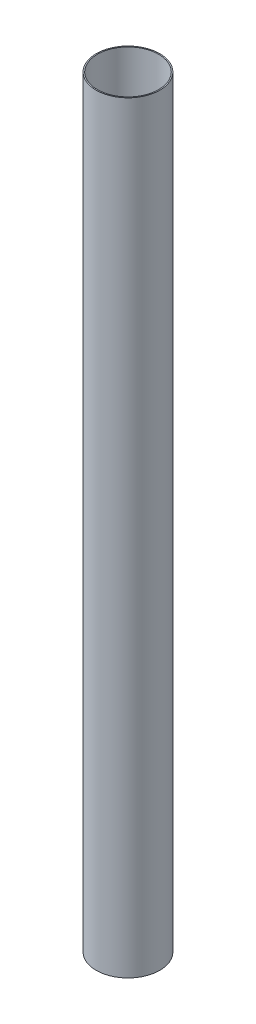
ISO-10303-21;
HEADER;
FILE_DESCRIPTION(('STEP AP214'),'2;1');
FILE_NAME('part.step','',(''),(''),'','','');
FILE_SCHEMA(('AUTOMOTIVE_DESIGN { 1 0 10303 214 1 1 1 1 }'));
ENDSEC;
DATA;
#1=APPLICATION_CONTEXT('core data for automotive mechanical design processes');
#2=APPLICATION_PROTOCOL_DEFINITION('international standard','automotive_design',2000,#1);
#3=PRODUCT_CONTEXT('',#1,'mechanical');
#4=PRODUCT('Part','Part','',(#3));
#5=PRODUCT_RELATED_PRODUCT_CATEGORY('part','',(#4));
#6=PRODUCT_DEFINITION_FORMATION('','',#4);
#7=PRODUCT_DEFINITION_CONTEXT('part definition',#1,'design');
#8=PRODUCT_DEFINITION('design','',#6,#7);
#9=PRODUCT_DEFINITION_SHAPE('','',#8);
#10=(LENGTH_UNIT() NAMED_UNIT(*) SI_UNIT(.MILLI.,.METRE.));
#11=(NAMED_UNIT(*) PLANE_ANGLE_UNIT() SI_UNIT($,.RADIAN.));
#12=(NAMED_UNIT(*) SI_UNIT($,.STERADIAN.) SOLID_ANGLE_UNIT());
#13=UNCERTAINTY_MEASURE_WITH_UNIT(LENGTH_MEASURE(1.E-05),#10,'distance_accuracy_value','');
#14=(GEOMETRIC_REPRESENTATION_CONTEXT(3) GLOBAL_UNCERTAINTY_ASSIGNED_CONTEXT((#13)) GLOBAL_UNIT_ASSIGNED_CONTEXT((#10,
#11,#12)) REPRESENTATION_CONTEXT('',''));
#15=CARTESIAN_POINT('',(0.,0.,0.));
#16=DIRECTION('',(0.,0.,1.));
#17=DIRECTION('',(1.,0.,0.));
#18=AXIS2_PLACEMENT_3D('',#15,#16,#17);
#19=CARTESIAN_POINT('',(0.,1020.,0.));
#20=DIRECTION('',(0.,1.,0.));
#21=DIRECTION('',(0.,0.,1.));
#22=AXIS2_PLACEMENT_3D('',#19,#20,#21);
#23=PLANE('',#22);
#24=CARTESIAN_POINT('',(0.,1020.,0.));
#25=DIRECTION('',(0.,1.,0.));
#26=DIRECTION('',(0.,0.,1.));
#27=AXIS2_PLACEMENT_3D('',#24,#25,#26);
#28=CIRCLE('',#27,42.5);
#29=CARTESIAN_POINT('',(0.,1020.,42.5));
#30=VERTEX_POINT('',#29);
#31=EDGE_CURVE('E10',#30,#30,#28,.T.);
#32=ORIENTED_EDGE('',*,*,#31,.T.);
#33=EDGE_LOOP('',(#32));
#34=FACE_BOUND('',#33,.T.);
#35=CARTESIAN_POINT('',(0.,1020.,0.));
#36=DIRECTION('',(0.,1.,0.));
#37=DIRECTION('',(0.,0.,1.));
#38=AXIS2_PLACEMENT_3D('',#35,#36,#37);
#39=CIRCLE('',#38,41.);
#40=CARTESIAN_POINT('',(0.,1020.,41.));
#41=VERTEX_POINT('',#40);
#42=EDGE_CURVE('E48',#41,#41,#39,.T.);
#43=ORIENTED_EDGE('',*,*,#42,.F.);
#44=EDGE_LOOP('',(#43));
#45=FACE_BOUND('',#44,.T.);
#46=ADVANCED_FACE('F37',(#34,#45),#23,.T.);
#47=CARTESIAN_POINT('',(0.,0.,0.));
#48=DIRECTION('',(0.,1.,0.));
#49=DIRECTION('',(0.,0.,1.));
#50=AXIS2_PLACEMENT_3D('',#47,#48,#49);
#51=PLANE('',#50);
#52=CARTESIAN_POINT('',(0.,0.,0.));
#53=DIRECTION('',(0.,1.,0.));
#54=DIRECTION('',(0.,0.,1.));
#55=AXIS2_PLACEMENT_3D('',#52,#53,#54);
#56=CIRCLE('',#55,42.5);
#57=CARTESIAN_POINT('',(0.,0.,42.5));
#58=VERTEX_POINT('',#57);
#59=EDGE_CURVE('E41',#58,#58,#56,.T.);
#60=ORIENTED_EDGE('',*,*,#59,.F.);
#61=EDGE_LOOP('',(#60));
#62=FACE_BOUND('',#61,.T.);
#63=CARTESIAN_POINT('',(0.,0.,0.));
#64=DIRECTION('',(0.,1.,0.));
#65=DIRECTION('',(0.,0.,1.));
#66=AXIS2_PLACEMENT_3D('',#63,#64,#65);
#67=CIRCLE('',#66,41.);
#68=CARTESIAN_POINT('',(0.,0.,41.));
#69=VERTEX_POINT('',#68);
#70=EDGE_CURVE('E50',#69,#69,#67,.T.);
#71=ORIENTED_EDGE('',*,*,#70,.T.);
#72=EDGE_LOOP('',(#71));
#73=FACE_BOUND('',#72,.T.);
#74=ADVANCED_FACE('F60',(#62,#73),#51,.F.);
#75=CARTESIAN_POINT('',(0.,1020.,0.));
#76=DIRECTION('',(0.,-1.,0.));
#77=DIRECTION('',(0.,0.,-1.));
#78=AXIS2_PLACEMENT_3D('',#75,#76,#77);
#79=CYLINDRICAL_SURFACE('',#78,42.5);
#80=ORIENTED_EDGE('',*,*,#31,.F.);
#81=EDGE_LOOP('',(#80));
#82=FACE_BOUND('',#81,.T.);
#83=ORIENTED_EDGE('',*,*,#59,.T.);
#84=EDGE_LOOP('',(#83));
#85=FACE_BOUND('',#84,.T.);
#86=ADVANCED_FACE('F39',(#82,#85),#79,.T.);
#87=CARTESIAN_POINT('',(0.,1020.,0.));
#88=DIRECTION('',(0.,-1.,0.));
#89=DIRECTION('',(0.,0.,-1.));
#90=AXIS2_PLACEMENT_3D('',#87,#88,#89);
#91=CYLINDRICAL_SURFACE('',#90,41.);
#92=ORIENTED_EDGE('',*,*,#42,.T.);
#93=EDGE_LOOP('',(#92));
#94=FACE_BOUND('',#93,.T.);
#95=ORIENTED_EDGE('',*,*,#70,.F.);
#96=EDGE_LOOP('',(#95));
#97=FACE_BOUND('',#96,.T.);
#98=ADVANCED_FACE('F56',(#94,#97),#91,.F.);
#99=CLOSED_SHELL('',(#46,#74,#86,#98));
#100=MANIFOLD_SOLID_BREP('B2',#99);
#101=ADVANCED_BREP_SHAPE_REPRESENTATION('',(#18,#100),#14);
#102=SHAPE_DEFINITION_REPRESENTATION(#9,#101);
ENDSEC;
END-ISO-10303-21;
